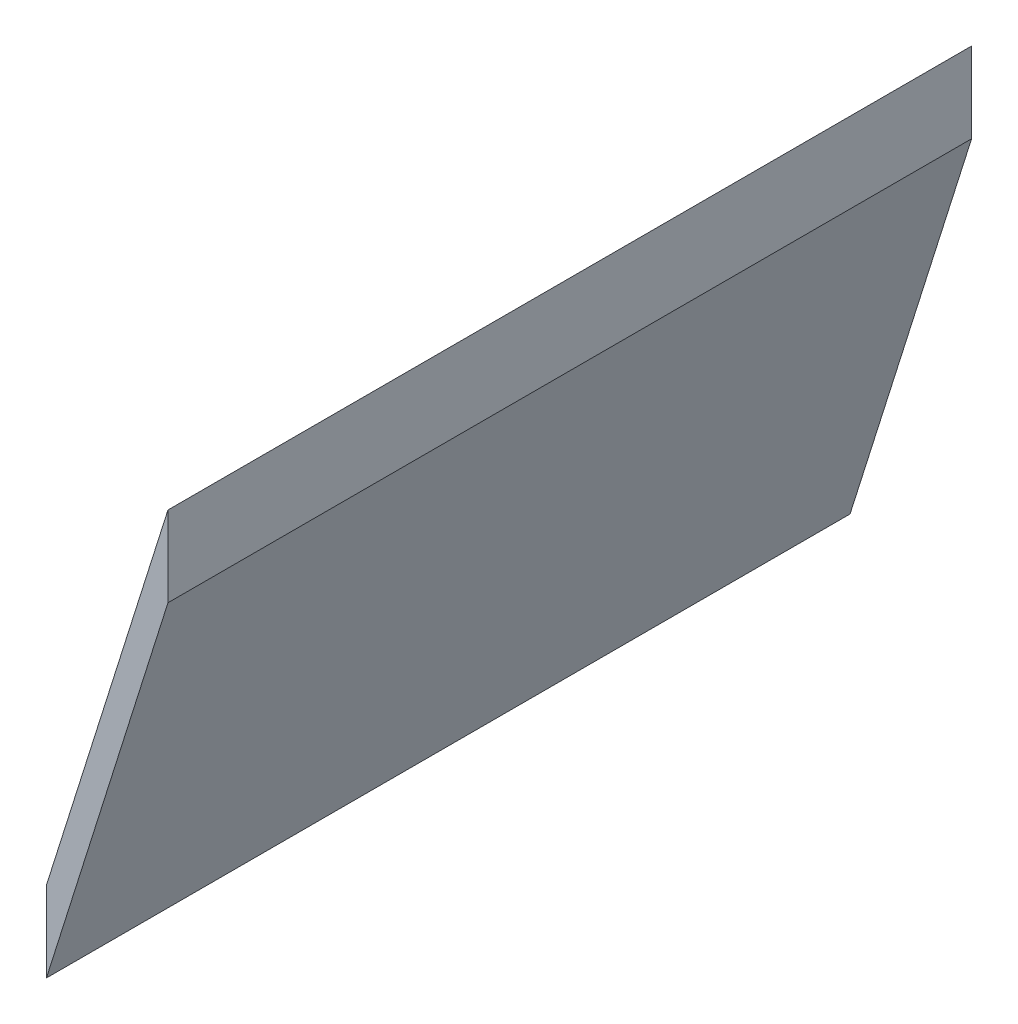
ISO-10303-21;
HEADER;
FILE_DESCRIPTION(('STEP AP214'),'2;1');
FILE_NAME('part.step','',(''),(''),'','','');
FILE_SCHEMA(('AUTOMOTIVE_DESIGN { 1 0 10303 214 1 1 1 1 }'));
ENDSEC;
DATA;
#1=APPLICATION_CONTEXT('core data for automotive mechanical design processes');
#2=APPLICATION_PROTOCOL_DEFINITION('international standard','automotive_design',2000,#1);
#3=PRODUCT_CONTEXT('',#1,'mechanical');
#4=PRODUCT('Part','Part','',(#3));
#5=PRODUCT_RELATED_PRODUCT_CATEGORY('part','',(#4));
#6=PRODUCT_DEFINITION_FORMATION('','',#4);
#7=PRODUCT_DEFINITION_CONTEXT('part definition',#1,'design');
#8=PRODUCT_DEFINITION('design','',#6,#7);
#9=PRODUCT_DEFINITION_SHAPE('','',#8);
#10=(LENGTH_UNIT() NAMED_UNIT(*) SI_UNIT(.MILLI.,.METRE.));
#11=(NAMED_UNIT(*) PLANE_ANGLE_UNIT() SI_UNIT($,.RADIAN.));
#12=(NAMED_UNIT(*) SI_UNIT($,.STERADIAN.) SOLID_ANGLE_UNIT());
#13=UNCERTAINTY_MEASURE_WITH_UNIT(LENGTH_MEASURE(1.E-05),#10,'distance_accuracy_value','');
#14=(GEOMETRIC_REPRESENTATION_CONTEXT(3) GLOBAL_UNCERTAINTY_ASSIGNED_CONTEXT((#13)) GLOBAL_UNIT_ASSIGNED_CONTEXT((#10,
#11,#12)) REPRESENTATION_CONTEXT('',''));
#15=CARTESIAN_POINT('',(0.,0.,0.));
#16=DIRECTION('',(0.,0.,1.));
#17=DIRECTION('',(1.,0.,0.));
#18=AXIS2_PLACEMENT_3D('',#15,#16,#17);
#19=CARTESIAN_POINT('',(0.71795591028076,-3.05051556849092,50.));
#20=DIRECTION('',(0.953769419284832,-0.300539339915881,0.));
#21=DIRECTION('',(0.300539339915881,0.953769419284833,0.));
#22=AXIS2_PLACEMENT_3D('',#19,#20,#21);
#23=PLANE('',#22);
#24=DIRECTION('',(-0.300539339915881,-0.953769419284832,0.));
#25=VECTOR('',#24,1.);
#26=CARTESIAN_POINT('',(0.71795591028076,-3.05051556849092,-50.));
#27=LINE('',#26,#25);
#28=CARTESIAN_POINT('',(15.8430878596562,44.9494844315091,-50.));
#29=VERTEX_POINT('',#28);
#30=CARTESIAN_POINT('',(0.71795591028076,-3.05051556849092,-50.));
#31=VERTEX_POINT('',#30);
#32=EDGE_CURVE('E99',#29,#31,#27,.T.);
#33=ORIENTED_EDGE('',*,*,#32,.T.);
#34=DIRECTION('',(0.,0.,-1.));
#35=VECTOR('',#34,1.);
#36=CARTESIAN_POINT('',(0.71795591028076,-3.05051556849092,50.));
#37=LINE('',#36,#35);
#38=CARTESIAN_POINT('',(0.71795591028076,-3.05051556849092,50.));
#39=VERTEX_POINT('',#38);
#40=EDGE_CURVE('E11',#39,#31,#37,.T.);
#41=ORIENTED_EDGE('',*,*,#40,.F.);
#42=DIRECTION('',(-0.300539339915881,-0.953769419284832,0.));
#43=VECTOR('',#42,1.);
#44=CARTESIAN_POINT('',(0.71795591028076,-3.05051556849092,50.));
#45=LINE('',#44,#43);
#46=CARTESIAN_POINT('',(15.8430878596562,44.9494844315091,50.));
#47=VERTEX_POINT('',#46);
#48=EDGE_CURVE('E87',#47,#39,#45,.T.);
#49=ORIENTED_EDGE('',*,*,#48,.F.);
#50=DIRECTION('',(0.,0.,-1.));
#51=VECTOR('',#50,1.);
#52=CARTESIAN_POINT('',(15.8430878596562,44.9494844315091,50.));
#53=LINE('',#52,#51);
#54=EDGE_CURVE('E95',#47,#29,#53,.T.);
#55=ORIENTED_EDGE('',*,*,#54,.T.);
#56=EDGE_LOOP('',(#33,#41,#49,#55));
#57=FACE_BOUND('',#56,.T.);
#58=ADVANCED_FACE('F36',(#57),#23,.F.);
#59=CARTESIAN_POINT('',(0.71795591028076,-13.0505155684909,50.));
#60=DIRECTION('',(1.,0.,0.));
#61=DIRECTION('',(0.,0.,-1.));
#62=AXIS2_PLACEMENT_3D('',#59,#60,#61);
#63=PLANE('',#62);
#64=DIRECTION('',(0.,-1.,0.));
#65=VECTOR('',#64,1.);
#66=CARTESIAN_POINT('',(0.71795591028076,-13.0505155684909,-50.));
#67=LINE('',#66,#65);
#68=CARTESIAN_POINT('',(0.71795591028076,-13.0505155684909,-50.));
#69=VERTEX_POINT('',#68);
#70=EDGE_CURVE('E91',#31,#69,#67,.T.);
#71=ORIENTED_EDGE('',*,*,#70,.T.);
#72=DIRECTION('',(0.,0.,-1.));
#73=VECTOR('',#72,1.);
#74=CARTESIAN_POINT('',(0.71795591028076,-13.0505155684909,50.));
#75=LINE('',#74,#73);
#76=CARTESIAN_POINT('',(0.71795591028076,-13.0505155684909,50.));
#77=VERTEX_POINT('',#76);
#78=EDGE_CURVE('E44',#77,#69,#75,.T.);
#79=ORIENTED_EDGE('',*,*,#78,.F.);
#80=DIRECTION('',(0.,-1.,0.));
#81=VECTOR('',#80,1.);
#82=CARTESIAN_POINT('',(0.71795591028076,-13.0505155684909,50.));
#83=LINE('',#82,#81);
#84=EDGE_CURVE('E82',#39,#77,#83,.T.);
#85=ORIENTED_EDGE('',*,*,#84,.F.);
#86=ORIENTED_EDGE('',*,*,#40,.T.);
#87=EDGE_LOOP('',(#71,#79,#85,#86));
#88=FACE_BOUND('',#87,.T.);
#89=ADVANCED_FACE('F90',(#88),#63,.F.);
#90=CARTESIAN_POINT('',(15.8430878596562,34.9494844315091,50.));
#91=DIRECTION('',(-0.953769419284832,0.300539339915881,0.));
#92=DIRECTION('',(-0.300539339915881,-0.953769419284833,0.));
#93=AXIS2_PLACEMENT_3D('',#90,#91,#92);
#94=PLANE('',#93);
#95=DIRECTION('',(0.300539339915881,0.953769419284832,0.));
#96=VECTOR('',#95,1.);
#97=CARTESIAN_POINT('',(15.8430878596562,34.9494844315091,-50.));
#98=LINE('',#97,#96);
#99=CARTESIAN_POINT('',(15.8430878596562,34.9494844315091,-50.));
#100=VERTEX_POINT('',#99);
#101=EDGE_CURVE('E69',#69,#100,#98,.T.);
#102=ORIENTED_EDGE('',*,*,#101,.T.);
#103=DIRECTION('',(0.,0.,-1.));
#104=VECTOR('',#103,1.);
#105=CARTESIAN_POINT('',(15.8430878596562,34.9494844315091,50.));
#106=LINE('',#105,#104);
#107=CARTESIAN_POINT('',(15.8430878596562,34.9494844315091,50.));
#108=VERTEX_POINT('',#107);
#109=EDGE_CURVE('E92',#108,#100,#106,.T.);
#110=ORIENTED_EDGE('',*,*,#109,.F.);
#111=DIRECTION('',(0.300539339915881,0.953769419284832,0.));
#112=VECTOR('',#111,1.);
#113=CARTESIAN_POINT('',(15.8430878596562,34.9494844315091,50.));
#114=LINE('',#113,#112);
#115=EDGE_CURVE('E85',#77,#108,#114,.T.);
#116=ORIENTED_EDGE('',*,*,#115,.F.);
#117=ORIENTED_EDGE('',*,*,#78,.T.);
#118=EDGE_LOOP('',(#102,#110,#116,#117));
#119=FACE_BOUND('',#118,.T.);
#120=ADVANCED_FACE('F93',(#119),#94,.F.);
#121=CARTESIAN_POINT('',(15.8430878596562,44.9494844315091,50.));
#122=DIRECTION('',(-1.,0.,0.));
#123=DIRECTION('',(0.,-1.,0.));
#124=AXIS2_PLACEMENT_3D('',#121,#122,#123);
#125=PLANE('',#124);
#126=DIRECTION('',(0.,1.,0.));
#127=VECTOR('',#126,1.);
#128=CARTESIAN_POINT('',(15.8430878596562,44.9494844315091,-50.));
#129=LINE('',#128,#127);
#130=EDGE_CURVE('E75',#100,#29,#129,.T.);
#131=ORIENTED_EDGE('',*,*,#130,.T.);
#132=ORIENTED_EDGE('',*,*,#54,.F.);
#133=DIRECTION('',(0.,1.,0.));
#134=VECTOR('',#133,1.);
#135=CARTESIAN_POINT('',(15.8430878596562,44.9494844315091,50.));
#136=LINE('',#135,#134);
#137=EDGE_CURVE('E52',#108,#47,#136,.T.);
#138=ORIENTED_EDGE('',*,*,#137,.F.);
#139=ORIENTED_EDGE('',*,*,#109,.T.);
#140=EDGE_LOOP('',(#131,#132,#138,#139));
#141=FACE_BOUND('',#140,.T.);
#142=ADVANCED_FACE('F106',(#141),#125,.F.);
#143=CARTESIAN_POINT('',(0.,0.,50.));
#144=DIRECTION('',(0.,0.,-1.));
#145=DIRECTION('',(-1.,0.,0.));
#146=AXIS2_PLACEMENT_3D('',#143,#144,#145);
#147=PLANE('',#146);
#148=ORIENTED_EDGE('',*,*,#48,.T.);
#149=ORIENTED_EDGE('',*,*,#84,.T.);
#150=ORIENTED_EDGE('',*,*,#115,.T.);
#151=ORIENTED_EDGE('',*,*,#137,.T.);
#152=EDGE_LOOP('',(#148,#149,#150,#151));
#153=FACE_BOUND('',#152,.T.);
#154=ADVANCED_FACE('F83',(#153),#147,.F.);
#155=CARTESIAN_POINT('',(0.,0.,-50.));
#156=DIRECTION('',(0.,0.,-1.));
#157=DIRECTION('',(-1.,0.,0.));
#158=AXIS2_PLACEMENT_3D('',#155,#156,#157);
#159=PLANE('',#158);
#160=ORIENTED_EDGE('',*,*,#32,.F.);
#161=ORIENTED_EDGE('',*,*,#130,.F.);
#162=ORIENTED_EDGE('',*,*,#101,.F.);
#163=ORIENTED_EDGE('',*,*,#70,.F.);
#164=EDGE_LOOP('',(#160,#161,#162,#163));
#165=FACE_BOUND('',#164,.T.);
#166=ADVANCED_FACE('F109',(#165),#159,.T.);
#167=CLOSED_SHELL('',(#58,#89,#120,#142,#154,#166));
#168=MANIFOLD_SOLID_BREP('B2',#167);
#169=ADVANCED_BREP_SHAPE_REPRESENTATION('',(#18,#168),#14);
#170=SHAPE_DEFINITION_REPRESENTATION(#9,#169);
ENDSEC;
END-ISO-10303-21;
